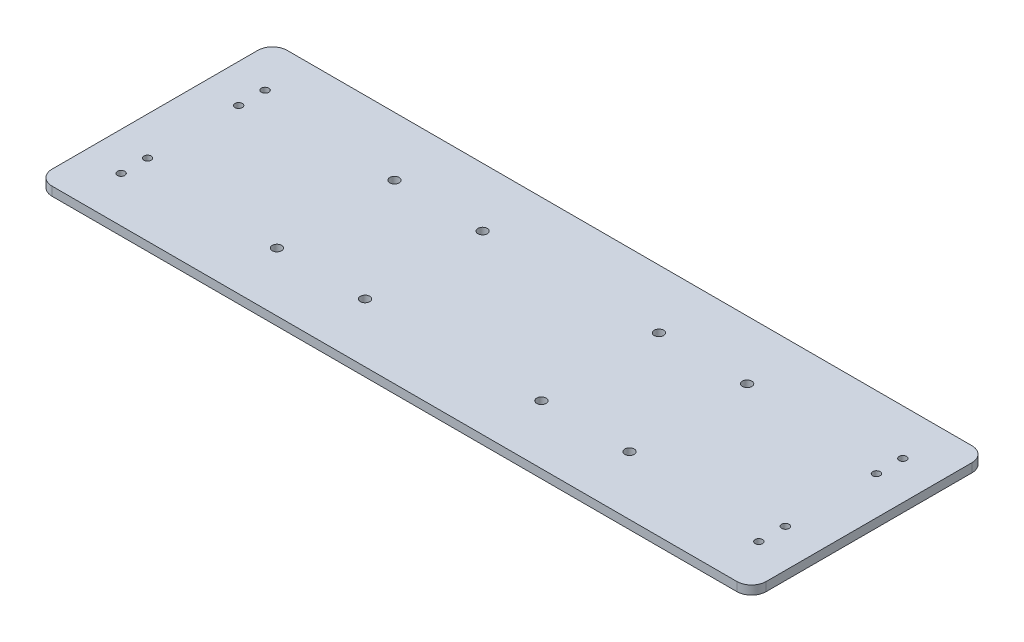
ISO-10303-21;
HEADER;
FILE_DESCRIPTION(('STEP AP214'),'2;1');
FILE_NAME('part.step','',(''),(''),'','','');
FILE_SCHEMA(('AUTOMOTIVE_DESIGN { 1 0 10303 214 1 1 1 1 }'));
ENDSEC;
DATA;
#1=APPLICATION_CONTEXT('core data for automotive mechanical design processes');
#2=APPLICATION_PROTOCOL_DEFINITION('international standard','automotive_design',2000,#1);
#3=PRODUCT_CONTEXT('',#1,'mechanical');
#4=PRODUCT('Part','Part','',(#3));
#5=PRODUCT_RELATED_PRODUCT_CATEGORY('part','',(#4));
#6=PRODUCT_DEFINITION_FORMATION('','',#4);
#7=PRODUCT_DEFINITION_CONTEXT('part definition',#1,'design');
#8=PRODUCT_DEFINITION('design','',#6,#7);
#9=PRODUCT_DEFINITION_SHAPE('','',#8);
#10=(LENGTH_UNIT() NAMED_UNIT(*) SI_UNIT(.MILLI.,.METRE.));
#11=(NAMED_UNIT(*) PLANE_ANGLE_UNIT() SI_UNIT($,.RADIAN.));
#12=(NAMED_UNIT(*) SI_UNIT($,.STERADIAN.) SOLID_ANGLE_UNIT());
#13=UNCERTAINTY_MEASURE_WITH_UNIT(LENGTH_MEASURE(1.E-05),#10,'distance_accuracy_value','');
#14=(GEOMETRIC_REPRESENTATION_CONTEXT(3) GLOBAL_UNCERTAINTY_ASSIGNED_CONTEXT((#13)) GLOBAL_UNIT_ASSIGNED_CONTEXT((#10,
#11,#12)) REPRESENTATION_CONTEXT('',''));
#15=CARTESIAN_POINT('',(0.,0.,0.));
#16=DIRECTION('',(0.,0.,1.));
#17=DIRECTION('',(1.,0.,0.));
#18=AXIS2_PLACEMENT_3D('',#15,#16,#17);
#19=CARTESIAN_POINT('',(0.,3.,0.));
#20=DIRECTION('',(1.,0.,0.));
#21=DIRECTION('',(0.,0.,-1.));
#22=AXIS2_PLACEMENT_3D('',#19,#20,#21);
#23=PLANE('',#22);
#24=DIRECTION('',(0.,0.,1.));
#25=VECTOR('',#24,1.);
#26=CARTESIAN_POINT('',(0.,0.,0.));
#27=LINE('',#26,#25);
#28=CARTESIAN_POINT('',(0.,0.,-75.));
#29=VERTEX_POINT('',#28);
#30=CARTESIAN_POINT('',(0.,0.,-5.));
#31=VERTEX_POINT('',#30);
#32=EDGE_CURVE('E140',#29,#31,#27,.T.);
#33=ORIENTED_EDGE('',*,*,#32,.T.);
#34=DIRECTION('',(0.,-1.,0.));
#35=VECTOR('',#34,1.);
#36=CARTESIAN_POINT('',(0.,3.,-5.));
#37=LINE('',#36,#35);
#38=CARTESIAN_POINT('',(0.,3.,-5.));
#39=VERTEX_POINT('',#38);
#40=EDGE_CURVE('E11',#31,#39,#37,.F.);
#41=ORIENTED_EDGE('',*,*,#40,.T.);
#42=DIRECTION('',(0.,0.,1.));
#43=VECTOR('',#42,1.);
#44=CARTESIAN_POINT('',(0.,3.,0.));
#45=LINE('',#44,#43);
#46=CARTESIAN_POINT('',(0.,3.,-75.));
#47=VERTEX_POINT('',#46);
#48=EDGE_CURVE('E138',#47,#39,#45,.T.);
#49=ORIENTED_EDGE('',*,*,#48,.F.);
#50=DIRECTION('',(0.,-1.,0.));
#51=VECTOR('',#50,1.);
#52=CARTESIAN_POINT('',(0.,3.,-75.));
#53=LINE('',#52,#51);
#54=EDGE_CURVE('E47',#47,#29,#53,.T.);
#55=ORIENTED_EDGE('',*,*,#54,.T.);
#56=EDGE_LOOP('',(#33,#41,#49,#55));
#57=FACE_BOUND('',#56,.T.);
#58=ADVANCED_FACE('F38',(#57),#23,.F.);
#59=CARTESIAN_POINT('',(0.,3.,0.));
#60=DIRECTION('',(0.,0.,-1.));
#61=DIRECTION('',(-1.,0.,0.));
#62=AXIS2_PLACEMENT_3D('',#59,#60,#61);
#63=PLANE('',#62);
#64=DIRECTION('',(1.,0.,0.));
#65=VECTOR('',#64,1.);
#66=CARTESIAN_POINT('',(0.,0.,0.));
#67=LINE('',#66,#65);
#68=CARTESIAN_POINT('',(5.,0.,0.));
#69=VERTEX_POINT('',#68);
#70=CARTESIAN_POINT('',(238.,0.,0.));
#71=VERTEX_POINT('',#70);
#72=EDGE_CURVE('E134',#69,#71,#67,.T.);
#73=ORIENTED_EDGE('',*,*,#72,.T.);
#74=DIRECTION('',(0.,-1.,0.));
#75=VECTOR('',#74,1.);
#76=CARTESIAN_POINT('',(238.,3.,0.));
#77=LINE('',#76,#75);
#78=CARTESIAN_POINT('',(238.,3.,0.));
#79=VERTEX_POINT('',#78);
#80=EDGE_CURVE('E110',#71,#79,#77,.F.);
#81=ORIENTED_EDGE('',*,*,#80,.T.);
#82=DIRECTION('',(1.,0.,0.));
#83=VECTOR('',#82,1.);
#84=CARTESIAN_POINT('',(0.,3.,0.));
#85=LINE('',#84,#83);
#86=CARTESIAN_POINT('',(5.,3.,0.));
#87=VERTEX_POINT('',#86);
#88=EDGE_CURVE('E197',#87,#79,#85,.T.);
#89=ORIENTED_EDGE('',*,*,#88,.F.);
#90=DIRECTION('',(0.,-1.,0.));
#91=VECTOR('',#90,1.);
#92=CARTESIAN_POINT('',(5.,3.,0.));
#93=LINE('',#92,#91);
#94=EDGE_CURVE('E116',#87,#69,#93,.T.);
#95=ORIENTED_EDGE('',*,*,#94,.T.);
#96=EDGE_LOOP('',(#73,#81,#89,#95));
#97=FACE_BOUND('',#96,.T.);
#98=ADVANCED_FACE('F372',(#97),#63,.F.);
#99=CARTESIAN_POINT('',(243.,3.,0.));
#100=DIRECTION('',(-1.,0.,0.));
#101=DIRECTION('',(0.,0.,1.));
#102=AXIS2_PLACEMENT_3D('',#99,#100,#101);
#103=PLANE('',#102);
#104=DIRECTION('',(0.,0.,-1.));
#105=VECTOR('',#104,1.);
#106=CARTESIAN_POINT('',(243.,3.,0.));
#107=LINE('',#106,#105);
#108=CARTESIAN_POINT('',(243.,3.,-5.));
#109=VERTEX_POINT('',#108);
#110=CARTESIAN_POINT('',(243.,3.,-75.));
#111=VERTEX_POINT('',#110);
#112=EDGE_CURVE('E125',#109,#111,#107,.T.);
#113=ORIENTED_EDGE('',*,*,#112,.F.);
#114=DIRECTION('',(0.,-1.,0.));
#115=VECTOR('',#114,1.);
#116=CARTESIAN_POINT('',(243.,3.,-5.));
#117=LINE('',#116,#115);
#118=CARTESIAN_POINT('',(243.,0.,-5.));
#119=VERTEX_POINT('',#118);
#120=EDGE_CURVE('E109',#109,#119,#117,.T.);
#121=ORIENTED_EDGE('',*,*,#120,.T.);
#122=DIRECTION('',(0.,0.,-1.));
#123=VECTOR('',#122,1.);
#124=CARTESIAN_POINT('',(243.,0.,0.));
#125=LINE('',#124,#123);
#126=CARTESIAN_POINT('',(243.,0.,-75.));
#127=VERTEX_POINT('',#126);
#128=EDGE_CURVE('E123',#119,#127,#125,.T.);
#129=ORIENTED_EDGE('',*,*,#128,.T.);
#130=DIRECTION('',(0.,-1.,0.));
#131=VECTOR('',#130,1.);
#132=CARTESIAN_POINT('',(243.,3.,-75.));
#133=LINE('',#132,#131);
#134=EDGE_CURVE('E128',#127,#111,#133,.F.);
#135=ORIENTED_EDGE('',*,*,#134,.T.);
#136=EDGE_LOOP('',(#113,#121,#129,#135));
#137=FACE_BOUND('',#136,.T.);
#138=ADVANCED_FACE('F122',(#137),#103,.F.);
#139=CARTESIAN_POINT('',(0.,3.,-80.));
#140=DIRECTION('',(0.,0.,1.));
#141=DIRECTION('',(1.,0.,0.));
#142=AXIS2_PLACEMENT_3D('',#139,#140,#141);
#143=PLANE('',#142);
#144=DIRECTION('',(-1.,0.,0.));
#145=VECTOR('',#144,1.);
#146=CARTESIAN_POINT('',(0.,3.,-80.));
#147=LINE('',#146,#145);
#148=CARTESIAN_POINT('',(238.,3.,-80.));
#149=VERTEX_POINT('',#148);
#150=CARTESIAN_POINT('',(5.,3.,-80.));
#151=VERTEX_POINT('',#150);
#152=EDGE_CURVE('E145',#149,#151,#147,.T.);
#153=ORIENTED_EDGE('',*,*,#152,.F.);
#154=DIRECTION('',(0.,-1.,0.));
#155=VECTOR('',#154,1.);
#156=CARTESIAN_POINT('',(238.,3.,-80.));
#157=LINE('',#156,#155);
#158=CARTESIAN_POINT('',(238.,0.,-80.));
#159=VERTEX_POINT('',#158);
#160=EDGE_CURVE('E172',#149,#159,#157,.T.);
#161=ORIENTED_EDGE('',*,*,#160,.T.);
#162=DIRECTION('',(-1.,0.,0.));
#163=VECTOR('',#162,1.);
#164=CARTESIAN_POINT('',(0.,0.,-80.));
#165=LINE('',#164,#163);
#166=CARTESIAN_POINT('',(5.,0.,-80.));
#167=VERTEX_POINT('',#166);
#168=EDGE_CURVE('E133',#159,#167,#165,.T.);
#169=ORIENTED_EDGE('',*,*,#168,.T.);
#170=DIRECTION('',(0.,-1.,0.));
#171=VECTOR('',#170,1.);
#172=CARTESIAN_POINT('',(5.,3.,-80.));
#173=LINE('',#172,#171);
#174=EDGE_CURVE('E54',#167,#151,#173,.F.);
#175=ORIENTED_EDGE('',*,*,#174,.T.);
#176=EDGE_LOOP('',(#153,#161,#169,#175));
#177=FACE_BOUND('',#176,.T.);
#178=ADVANCED_FACE('F365',(#177),#143,.F.);
#179=CARTESIAN_POINT('',(0.,3.,0.));
#180=DIRECTION('',(0.,-1.,0.));
#181=DIRECTION('',(0.,0.,-1.));
#182=AXIS2_PLACEMENT_3D('',#179,#180,#181);
#183=PLANE('',#182);
#184=CARTESIAN_POINT('',(91.5,3.,-20.));
#185=DIRECTION('',(0.,-1.,0.));
#186=DIRECTION('',(0.,0.,-1.));
#187=AXIS2_PLACEMENT_3D('',#184,#185,#186);
#188=CIRCLE('',#187,1.6);
#189=CARTESIAN_POINT('',(91.5,3.,-21.6));
#190=VERTEX_POINT('',#189);
#191=EDGE_CURVE('E256',#190,#190,#188,.T.);
#192=ORIENTED_EDGE('',*,*,#191,.T.);
#193=EDGE_LOOP('',(#192));
#194=FACE_BOUND('',#193,.T.);
#195=CARTESIAN_POINT('',(151.5,3.,-20.));
#196=DIRECTION('',(0.,-1.,0.));
#197=DIRECTION('',(0.,0.,-1.));
#198=AXIS2_PLACEMENT_3D('',#195,#196,#197);
#199=CIRCLE('',#198,1.60000000000002);
#200=CARTESIAN_POINT('',(151.5,3.,-21.6));
#201=VERTEX_POINT('',#200);
#202=EDGE_CURVE('E266',#201,#201,#199,.T.);
#203=ORIENTED_EDGE('',*,*,#202,.T.);
#204=EDGE_LOOP('',(#203));
#205=FACE_BOUND('',#204,.T.);
#206=CARTESIAN_POINT('',(181.5,3.,-20.));
#207=DIRECTION('',(0.,-1.,0.));
#208=DIRECTION('',(0.,0.,-1.));
#209=AXIS2_PLACEMENT_3D('',#206,#207,#208);
#210=CIRCLE('',#209,1.59999999999999);
#211=CARTESIAN_POINT('',(181.5,3.,-21.6));
#212=VERTEX_POINT('',#211);
#213=EDGE_CURVE('E270',#212,#212,#210,.T.);
#214=ORIENTED_EDGE('',*,*,#213,.T.);
#215=EDGE_LOOP('',(#214));
#216=FACE_BOUND('',#215,.T.);
#217=CARTESIAN_POINT('',(181.5,3.,-60.));
#218=DIRECTION('',(0.,-1.,0.));
#219=DIRECTION('',(0.,0.,-1.));
#220=AXIS2_PLACEMENT_3D('',#217,#218,#219);
#221=CIRCLE('',#220,1.59999999999999);
#222=CARTESIAN_POINT('',(181.5,3.,-61.6));
#223=VERTEX_POINT('',#222);
#224=EDGE_CURVE('E274',#223,#223,#221,.T.);
#225=ORIENTED_EDGE('',*,*,#224,.T.);
#226=EDGE_LOOP('',(#225));
#227=FACE_BOUND('',#226,.T.);
#228=CARTESIAN_POINT('',(151.5,3.,-60.));
#229=DIRECTION('',(0.,-1.,0.));
#230=DIRECTION('',(0.,0.,-1.));
#231=AXIS2_PLACEMENT_3D('',#228,#229,#230);
#232=CIRCLE('',#231,1.60000000000002);
#233=CARTESIAN_POINT('',(151.5,3.,-61.6));
#234=VERTEX_POINT('',#233);
#235=EDGE_CURVE('E278',#234,#234,#232,.T.);
#236=ORIENTED_EDGE('',*,*,#235,.T.);
#237=EDGE_LOOP('',(#236));
#238=FACE_BOUND('',#237,.T.);
#239=CARTESIAN_POINT('',(91.5,3.,-60.));
#240=DIRECTION('',(0.,-1.,0.));
#241=DIRECTION('',(0.,0.,-1.));
#242=AXIS2_PLACEMENT_3D('',#239,#240,#241);
#243=CIRCLE('',#242,1.6);
#244=CARTESIAN_POINT('',(91.5,3.,-61.6));
#245=VERTEX_POINT('',#244);
#246=EDGE_CURVE('E282',#245,#245,#243,.T.);
#247=ORIENTED_EDGE('',*,*,#246,.T.);
#248=EDGE_LOOP('',(#247));
#249=FACE_BOUND('',#248,.T.);
#250=CARTESIAN_POINT('',(61.5,3.,-60.));
#251=DIRECTION('',(0.,-1.,0.));
#252=DIRECTION('',(0.,0.,-1.));
#253=AXIS2_PLACEMENT_3D('',#250,#251,#252);
#254=CIRCLE('',#253,1.6);
#255=CARTESIAN_POINT('',(61.5,3.,-61.6));
#256=VERTEX_POINT('',#255);
#257=EDGE_CURVE('E286',#256,#256,#254,.T.);
#258=ORIENTED_EDGE('',*,*,#257,.T.);
#259=EDGE_LOOP('',(#258));
#260=FACE_BOUND('',#259,.T.);
#261=CARTESIAN_POINT('',(61.5,3.,-20.));
#262=DIRECTION('',(0.,-1.,0.));
#263=DIRECTION('',(0.,0.,-1.));
#264=AXIS2_PLACEMENT_3D('',#261,#262,#263);
#265=CIRCLE('',#264,1.6);
#266=CARTESIAN_POINT('',(61.5,3.,-21.6));
#267=VERTEX_POINT('',#266);
#268=EDGE_CURVE('E290',#267,#267,#265,.T.);
#269=ORIENTED_EDGE('',*,*,#268,.T.);
#270=EDGE_LOOP('',(#269));
#271=FACE_BOUND('',#270,.T.);
#272=CARTESIAN_POINT('',(230.,3.,-55.4999999999999));
#273=DIRECTION('',(0.,-1.,0.));
#274=DIRECTION('',(0.,0.,-1.));
#275=AXIS2_PLACEMENT_3D('',#272,#273,#274);
#276=CIRCLE('',#275,1.24999999999998);
#277=CARTESIAN_POINT('',(230.,3.,-56.7499999999999));
#278=VERTEX_POINT('',#277);
#279=EDGE_CURVE('E187',#278,#278,#276,.T.);
#280=ORIENTED_EDGE('',*,*,#279,.T.);
#281=EDGE_LOOP('',(#280));
#282=FACE_BOUND('',#281,.T.);
#283=CARTESIAN_POINT('',(13.,3.,-15.5));
#284=DIRECTION('',(0.,-1.,0.));
#285=DIRECTION('',(0.,0.,-1.));
#286=AXIS2_PLACEMENT_3D('',#283,#284,#285);
#287=CIRCLE('',#286,1.25);
#288=CARTESIAN_POINT('',(13.,3.,-16.75));
#289=VERTEX_POINT('',#288);
#290=EDGE_CURVE('E190',#289,#289,#287,.T.);
#291=ORIENTED_EDGE('',*,*,#290,.T.);
#292=EDGE_LOOP('',(#291));
#293=FACE_BOUND('',#292,.T.);
#294=CARTESIAN_POINT('',(13.,3.,-24.5));
#295=DIRECTION('',(0.,-1.,0.));
#296=DIRECTION('',(0.,0.,-1.));
#297=AXIS2_PLACEMENT_3D('',#294,#295,#296);
#298=CIRCLE('',#297,1.25);
#299=CARTESIAN_POINT('',(13.,3.,-25.75));
#300=VERTEX_POINT('',#299);
#301=EDGE_CURVE('E206',#300,#300,#298,.T.);
#302=ORIENTED_EDGE('',*,*,#301,.T.);
#303=EDGE_LOOP('',(#302));
#304=FACE_BOUND('',#303,.T.);
#305=CARTESIAN_POINT('',(13.,3.,-55.5));
#306=DIRECTION('',(0.,-1.,0.));
#307=DIRECTION('',(0.,0.,-1.));
#308=AXIS2_PLACEMENT_3D('',#305,#306,#307);
#309=CIRCLE('',#308,1.25);
#310=CARTESIAN_POINT('',(13.,3.,-56.75));
#311=VERTEX_POINT('',#310);
#312=EDGE_CURVE('E210',#311,#311,#309,.T.);
#313=ORIENTED_EDGE('',*,*,#312,.T.);
#314=EDGE_LOOP('',(#313));
#315=FACE_BOUND('',#314,.T.);
#316=CARTESIAN_POINT('',(230.,3.,-64.4999999999999));
#317=DIRECTION('',(0.,-1.,0.));
#318=DIRECTION('',(0.,0.,-1.));
#319=AXIS2_PLACEMENT_3D('',#316,#317,#318);
#320=CIRCLE('',#319,1.24999999999998);
#321=CARTESIAN_POINT('',(230.,3.,-65.7499999999999));
#322=VERTEX_POINT('',#321);
#323=EDGE_CURVE('E214',#322,#322,#320,.T.);
#324=ORIENTED_EDGE('',*,*,#323,.T.);
#325=EDGE_LOOP('',(#324));
#326=FACE_BOUND('',#325,.T.);
#327=CARTESIAN_POINT('',(230.,3.,-24.4999999999999));
#328=DIRECTION('',(0.,-1.,0.));
#329=DIRECTION('',(0.,0.,-1.));
#330=AXIS2_PLACEMENT_3D('',#327,#328,#329);
#331=CIRCLE('',#330,1.25000000000001);
#332=CARTESIAN_POINT('',(230.,3.,-25.7499999999999));
#333=VERTEX_POINT('',#332);
#334=EDGE_CURVE('E218',#333,#333,#331,.T.);
#335=ORIENTED_EDGE('',*,*,#334,.T.);
#336=EDGE_LOOP('',(#335));
#337=FACE_BOUND('',#336,.T.);
#338=CARTESIAN_POINT('',(230.,3.,-15.4999999999999));
#339=DIRECTION('',(0.,-1.,0.));
#340=DIRECTION('',(0.,0.,-1.));
#341=AXIS2_PLACEMENT_3D('',#338,#339,#340);
#342=CIRCLE('',#341,1.25000000000001);
#343=CARTESIAN_POINT('',(230.,3.,-16.7499999999999));
#344=VERTEX_POINT('',#343);
#345=EDGE_CURVE('E222',#344,#344,#342,.T.);
#346=ORIENTED_EDGE('',*,*,#345,.T.);
#347=EDGE_LOOP('',(#346));
#348=FACE_BOUND('',#347,.T.);
#349=CARTESIAN_POINT('',(13.,3.,-64.5));
#350=DIRECTION('',(0.,-1.,0.));
#351=DIRECTION('',(0.,0.,-1.));
#352=AXIS2_PLACEMENT_3D('',#349,#350,#351);
#353=CIRCLE('',#352,1.25);
#354=CARTESIAN_POINT('',(13.,3.,-65.75));
#355=VERTEX_POINT('',#354);
#356=EDGE_CURVE('E226',#355,#355,#353,.T.);
#357=ORIENTED_EDGE('',*,*,#356,.T.);
#358=EDGE_LOOP('',(#357));
#359=FACE_BOUND('',#358,.T.);
#360=ORIENTED_EDGE('',*,*,#88,.T.);
#361=CARTESIAN_POINT('',(238.,3.,-5.));
#362=DIRECTION('',(0.,-1.,0.));
#363=DIRECTION('',(0.,0.,-1.));
#364=AXIS2_PLACEMENT_3D('',#361,#362,#363);
#365=CIRCLE('',#364,5.);
#366=EDGE_CURVE('E167',#79,#109,#365,.F.);
#367=ORIENTED_EDGE('',*,*,#366,.T.);
#368=ORIENTED_EDGE('',*,*,#112,.T.);
#369=CARTESIAN_POINT('',(238.,3.,-75.));
#370=DIRECTION('',(0.,-1.,0.));
#371=DIRECTION('',(0.,0.,-1.));
#372=AXIS2_PLACEMENT_3D('',#369,#370,#371);
#373=CIRCLE('',#372,5.);
#374=EDGE_CURVE('E61',#111,#149,#373,.F.);
#375=ORIENTED_EDGE('',*,*,#374,.T.);
#376=ORIENTED_EDGE('',*,*,#152,.T.);
#377=CARTESIAN_POINT('',(5.,3.,-75.));
#378=DIRECTION('',(0.,-1.,0.));
#379=DIRECTION('',(0.,0.,-1.));
#380=AXIS2_PLACEMENT_3D('',#377,#378,#379);
#381=CIRCLE('',#380,5.);
#382=EDGE_CURVE('E159',#151,#47,#381,.F.);
#383=ORIENTED_EDGE('',*,*,#382,.T.);
#384=ORIENTED_EDGE('',*,*,#48,.T.);
#385=CARTESIAN_POINT('',(5.,3.,-5.));
#386=DIRECTION('',(0.,-1.,0.));
#387=DIRECTION('',(0.,0.,-1.));
#388=AXIS2_PLACEMENT_3D('',#385,#386,#387);
#389=CIRCLE('',#388,5.);
#390=EDGE_CURVE('E162',#39,#87,#389,.F.);
#391=ORIENTED_EDGE('',*,*,#390,.T.);
#392=EDGE_LOOP('',(#360,#367,#368,#375,#376,#383,#384,#391));
#393=FACE_BOUND('',#392,.T.);
#394=ADVANCED_FACE('F333',(#194,#205,#216,#227,#238,#249,#260,#271,#282,#293,#304,#315,#326,
#337,#348,#359,#393),#183,.F.);
#395=CARTESIAN_POINT('',(0.,0.,0.));
#396=DIRECTION('',(0.,-1.,0.));
#397=DIRECTION('',(0.,0.,-1.));
#398=AXIS2_PLACEMENT_3D('',#395,#396,#397);
#399=PLANE('',#398);
#400=CARTESIAN_POINT('',(91.5,0.,-20.));
#401=DIRECTION('',(0.,-1.,0.));
#402=DIRECTION('',(0.,0.,-1.));
#403=AXIS2_PLACEMENT_3D('',#400,#401,#402);
#404=CIRCLE('',#403,1.6);
#405=CARTESIAN_POINT('',(91.5,0.,-21.6));
#406=VERTEX_POINT('',#405);
#407=EDGE_CURVE('E298',#406,#406,#404,.T.);
#408=ORIENTED_EDGE('',*,*,#407,.F.);
#409=EDGE_LOOP('',(#408));
#410=FACE_BOUND('',#409,.T.);
#411=CARTESIAN_POINT('',(151.5,0.,-20.));
#412=DIRECTION('',(0.,-1.,0.));
#413=DIRECTION('',(0.,0.,1.));
#414=AXIS2_PLACEMENT_3D('',#411,#412,#413);
#415=CIRCLE('',#414,1.60000000000002);
#416=CARTESIAN_POINT('',(151.5,0.,-18.4));
#417=VERTEX_POINT('',#416);
#418=EDGE_CURVE('E308',#417,#417,#415,.T.);
#419=ORIENTED_EDGE('',*,*,#418,.F.);
#420=EDGE_LOOP('',(#419));
#421=FACE_BOUND('',#420,.T.);
#422=CARTESIAN_POINT('',(181.5,0.,-20.));
#423=DIRECTION('',(0.,-1.,0.));
#424=DIRECTION('',(0.,0.,1.));
#425=AXIS2_PLACEMENT_3D('',#422,#423,#424);
#426=CIRCLE('',#425,1.59999999999999);
#427=CARTESIAN_POINT('',(181.5,0.,-18.4));
#428=VERTEX_POINT('',#427);
#429=EDGE_CURVE('E303',#428,#428,#426,.T.);
#430=ORIENTED_EDGE('',*,*,#429,.F.);
#431=EDGE_LOOP('',(#430));
#432=FACE_BOUND('',#431,.T.);
#433=CARTESIAN_POINT('',(181.5,0.,-60.));
#434=DIRECTION('',(0.,-1.,0.));
#435=DIRECTION('',(0.,0.,-1.));
#436=AXIS2_PLACEMENT_3D('',#433,#434,#435);
#437=CIRCLE('',#436,1.59999999999999);
#438=CARTESIAN_POINT('',(181.5,0.,-61.6));
#439=VERTEX_POINT('',#438);
#440=EDGE_CURVE('E299',#439,#439,#437,.T.);
#441=ORIENTED_EDGE('',*,*,#440,.F.);
#442=EDGE_LOOP('',(#441));
#443=FACE_BOUND('',#442,.T.);
#444=CARTESIAN_POINT('',(151.5,0.,-60.));
#445=DIRECTION('',(0.,-1.,0.));
#446=DIRECTION('',(0.,0.,-1.));
#447=AXIS2_PLACEMENT_3D('',#444,#445,#446);
#448=CIRCLE('',#447,1.60000000000002);
#449=CARTESIAN_POINT('',(151.5,0.,-61.6));
#450=VERTEX_POINT('',#449);
#451=EDGE_CURVE('E304',#450,#450,#448,.T.);
#452=ORIENTED_EDGE('',*,*,#451,.F.);
#453=EDGE_LOOP('',(#452));
#454=FACE_BOUND('',#453,.T.);
#455=CARTESIAN_POINT('',(91.5,0.,-60.));
#456=DIRECTION('',(0.,-1.,0.));
#457=DIRECTION('',(0.,0.,1.));
#458=AXIS2_PLACEMENT_3D('',#455,#456,#457);
#459=CIRCLE('',#458,1.6);
#460=CARTESIAN_POINT('',(91.5,0.,-58.4));
#461=VERTEX_POINT('',#460);
#462=EDGE_CURVE('E319',#461,#461,#459,.T.);
#463=ORIENTED_EDGE('',*,*,#462,.F.);
#464=EDGE_LOOP('',(#463));
#465=FACE_BOUND('',#464,.T.);
#466=CARTESIAN_POINT('',(61.5,0.,-60.));
#467=DIRECTION('',(0.,-1.,0.));
#468=DIRECTION('',(0.,0.,1.));
#469=AXIS2_PLACEMENT_3D('',#466,#467,#468);
#470=CIRCLE('',#469,1.6);
#471=CARTESIAN_POINT('',(61.5,0.,-58.4));
#472=VERTEX_POINT('',#471);
#473=EDGE_CURVE('E315',#472,#472,#470,.T.);
#474=ORIENTED_EDGE('',*,*,#473,.F.);
#475=EDGE_LOOP('',(#474));
#476=FACE_BOUND('',#475,.T.);
#477=CARTESIAN_POINT('',(61.5,0.,-20.));
#478=DIRECTION('',(0.,-1.,0.));
#479=DIRECTION('',(0.,0.,-1.));
#480=AXIS2_PLACEMENT_3D('',#477,#478,#479);
#481=CIRCLE('',#480,1.6);
#482=CARTESIAN_POINT('',(61.5,0.,-21.6));
#483=VERTEX_POINT('',#482);
#484=EDGE_CURVE('E294',#483,#483,#481,.T.);
#485=ORIENTED_EDGE('',*,*,#484,.F.);
#486=EDGE_LOOP('',(#485));
#487=FACE_BOUND('',#486,.T.);
#488=CARTESIAN_POINT('',(230.,0.,-55.4999999999999));
#489=DIRECTION('',(0.,-1.,0.));
#490=DIRECTION('',(0.,0.,-1.));
#491=AXIS2_PLACEMENT_3D('',#488,#489,#490);
#492=CIRCLE('',#491,1.24999999999998);
#493=CARTESIAN_POINT('',(230.,0.,-56.7499999999999));
#494=VERTEX_POINT('',#493);
#495=EDGE_CURVE('E243',#494,#494,#492,.T.);
#496=ORIENTED_EDGE('',*,*,#495,.F.);
#497=EDGE_LOOP('',(#496));
#498=FACE_BOUND('',#497,.T.);
#499=CARTESIAN_POINT('',(13.,0.,-15.5));
#500=DIRECTION('',(0.,-1.,0.));
#501=DIRECTION('',(0.,0.,-1.));
#502=AXIS2_PLACEMENT_3D('',#499,#500,#501);
#503=CIRCLE('',#502,1.25);
#504=CARTESIAN_POINT('',(13.,0.,-16.75));
#505=VERTEX_POINT('',#504);
#506=EDGE_CURVE('E239',#505,#505,#503,.T.);
#507=ORIENTED_EDGE('',*,*,#506,.F.);
#508=EDGE_LOOP('',(#507));
#509=FACE_BOUND('',#508,.T.);
#510=CARTESIAN_POINT('',(13.,0.,-24.5));
#511=DIRECTION('',(0.,-1.,0.));
#512=DIRECTION('',(0.,0.,-1.));
#513=AXIS2_PLACEMENT_3D('',#510,#511,#512);
#514=CIRCLE('',#513,1.25);
#515=CARTESIAN_POINT('',(13.,0.,-25.75));
#516=VERTEX_POINT('',#515);
#517=EDGE_CURVE('E235',#516,#516,#514,.T.);
#518=ORIENTED_EDGE('',*,*,#517,.F.);
#519=EDGE_LOOP('',(#518));
#520=FACE_BOUND('',#519,.T.);
#521=CARTESIAN_POINT('',(13.,0.,-55.5));
#522=DIRECTION('',(0.,-1.,0.));
#523=DIRECTION('',(0.,0.,-1.));
#524=AXIS2_PLACEMENT_3D('',#521,#522,#523);
#525=CIRCLE('',#524,1.25);
#526=CARTESIAN_POINT('',(13.,0.,-56.75));
#527=VERTEX_POINT('',#526);
#528=EDGE_CURVE('E234',#527,#527,#525,.T.);
#529=ORIENTED_EDGE('',*,*,#528,.F.);
#530=EDGE_LOOP('',(#529));
#531=FACE_BOUND('',#530,.T.);
#532=CARTESIAN_POINT('',(230.,0.,-64.4999999999999));
#533=DIRECTION('',(0.,-1.,0.));
#534=DIRECTION('',(0.,0.,-1.));
#535=AXIS2_PLACEMENT_3D('',#532,#533,#534);
#536=CIRCLE('',#535,1.24999999999998);
#537=CARTESIAN_POINT('',(230.,0.,-65.7499999999999));
#538=VERTEX_POINT('',#537);
#539=EDGE_CURVE('E247',#538,#538,#536,.T.);
#540=ORIENTED_EDGE('',*,*,#539,.F.);
#541=EDGE_LOOP('',(#540));
#542=FACE_BOUND('',#541,.T.);
#543=CARTESIAN_POINT('',(230.,0.,-24.4999999999999));
#544=DIRECTION('',(0.,-1.,0.));
#545=DIRECTION('',(0.,0.,-1.));
#546=AXIS2_PLACEMENT_3D('',#543,#544,#545);
#547=CIRCLE('',#546,1.25000000000001);
#548=CARTESIAN_POINT('',(230.,0.,-25.7499999999999));
#549=VERTEX_POINT('',#548);
#550=EDGE_CURVE('E255',#549,#549,#547,.T.);
#551=ORIENTED_EDGE('',*,*,#550,.F.);
#552=EDGE_LOOP('',(#551));
#553=FACE_BOUND('',#552,.T.);
#554=CARTESIAN_POINT('',(230.,0.,-15.4999999999999));
#555=DIRECTION('',(0.,-1.,0.));
#556=DIRECTION('',(0.,0.,-1.));
#557=AXIS2_PLACEMENT_3D('',#554,#555,#556);
#558=CIRCLE('',#557,1.25000000000001);
#559=CARTESIAN_POINT('',(230.,0.,-16.7499999999999));
#560=VERTEX_POINT('',#559);
#561=EDGE_CURVE('E251',#560,#560,#558,.T.);
#562=ORIENTED_EDGE('',*,*,#561,.F.);
#563=EDGE_LOOP('',(#562));
#564=FACE_BOUND('',#563,.T.);
#565=CARTESIAN_POINT('',(13.,0.,-64.5));
#566=DIRECTION('',(0.,-1.,0.));
#567=DIRECTION('',(0.,0.,-1.));
#568=AXIS2_PLACEMENT_3D('',#565,#566,#567);
#569=CIRCLE('',#568,1.25);
#570=CARTESIAN_POINT('',(13.,0.,-65.75));
#571=VERTEX_POINT('',#570);
#572=EDGE_CURVE('E230',#571,#571,#569,.T.);
#573=ORIENTED_EDGE('',*,*,#572,.F.);
#574=EDGE_LOOP('',(#573));
#575=FACE_BOUND('',#574,.T.);
#576=ORIENTED_EDGE('',*,*,#128,.F.);
#577=CARTESIAN_POINT('',(238.,0.,-5.));
#578=DIRECTION('',(0.,-1.,0.));
#579=DIRECTION('',(0.,0.,-1.));
#580=AXIS2_PLACEMENT_3D('',#577,#578,#579);
#581=CIRCLE('',#580,5.);
#582=EDGE_CURVE('E105',#119,#71,#581,.T.);
#583=ORIENTED_EDGE('',*,*,#582,.T.);
#584=ORIENTED_EDGE('',*,*,#72,.F.);
#585=CARTESIAN_POINT('',(5.,0.,-5.));
#586=DIRECTION('',(0.,-1.,0.));
#587=DIRECTION('',(0.,0.,-1.));
#588=AXIS2_PLACEMENT_3D('',#585,#586,#587);
#589=CIRCLE('',#588,5.);
#590=EDGE_CURVE('E149',#69,#31,#589,.T.);
#591=ORIENTED_EDGE('',*,*,#590,.T.);
#592=ORIENTED_EDGE('',*,*,#32,.F.);
#593=CARTESIAN_POINT('',(5.,0.,-75.));
#594=DIRECTION('',(0.,-1.,0.));
#595=DIRECTION('',(0.,0.,-1.));
#596=AXIS2_PLACEMENT_3D('',#593,#594,#595);
#597=CIRCLE('',#596,5.);
#598=EDGE_CURVE('E127',#29,#167,#597,.T.);
#599=ORIENTED_EDGE('',*,*,#598,.T.);
#600=ORIENTED_EDGE('',*,*,#168,.F.);
#601=CARTESIAN_POINT('',(238.,0.,-75.));
#602=DIRECTION('',(0.,-1.,0.));
#603=DIRECTION('',(0.,0.,-1.));
#604=AXIS2_PLACEMENT_3D('',#601,#602,#603);
#605=CIRCLE('',#604,5.);
#606=EDGE_CURVE('E117',#159,#127,#605,.T.);
#607=ORIENTED_EDGE('',*,*,#606,.T.);
#608=EDGE_LOOP('',(#576,#583,#584,#591,#592,#599,#600,#607));
#609=FACE_BOUND('',#608,.T.);
#610=ADVANCED_FACE('F130',(#410,#421,#432,#443,#454,#465,#476,#487,#498,#509,#520,#531,#542,
#553,#564,#575,#609),#399,.T.);
#611=CARTESIAN_POINT('',(13.,10.,-64.5));
#612=DIRECTION('',(0.,-1.,0.));
#613=DIRECTION('',(0.,0.,-1.));
#614=AXIS2_PLACEMENT_3D('',#611,#612,#613);
#615=CYLINDRICAL_SURFACE('',#614,1.25);
#616=ORIENTED_EDGE('',*,*,#572,.T.);
#617=EDGE_LOOP('',(#616));
#618=FACE_BOUND('',#617,.T.);
#619=ORIENTED_EDGE('',*,*,#356,.F.);
#620=EDGE_LOOP('',(#619));
#621=FACE_BOUND('',#620,.T.);
#622=ADVANCED_FACE('F332',(#618,#621),#615,.F.);
#623=CARTESIAN_POINT('',(230.,10.,-15.4999999999999));
#624=DIRECTION('',(0.,-1.,0.));
#625=DIRECTION('',(0.,0.,-1.));
#626=AXIS2_PLACEMENT_3D('',#623,#624,#625);
#627=CYLINDRICAL_SURFACE('',#626,1.25000000000001);
#628=ORIENTED_EDGE('',*,*,#561,.T.);
#629=EDGE_LOOP('',(#628));
#630=FACE_BOUND('',#629,.T.);
#631=ORIENTED_EDGE('',*,*,#345,.F.);
#632=EDGE_LOOP('',(#631));
#633=FACE_BOUND('',#632,.T.);
#634=ADVANCED_FACE('F360',(#630,#633),#627,.F.);
#635=CARTESIAN_POINT('',(230.,10.,-24.4999999999999));
#636=DIRECTION('',(0.,-1.,0.));
#637=DIRECTION('',(0.,0.,-1.));
#638=AXIS2_PLACEMENT_3D('',#635,#636,#637);
#639=CYLINDRICAL_SURFACE('',#638,1.25000000000001);
#640=ORIENTED_EDGE('',*,*,#550,.T.);
#641=EDGE_LOOP('',(#640));
#642=FACE_BOUND('',#641,.T.);
#643=ORIENTED_EDGE('',*,*,#334,.F.);
#644=EDGE_LOOP('',(#643));
#645=FACE_BOUND('',#644,.T.);
#646=ADVANCED_FACE('F426',(#642,#645),#639,.F.);
#647=CARTESIAN_POINT('',(230.,10.,-64.4999999999999));
#648=DIRECTION('',(0.,-1.,0.));
#649=DIRECTION('',(0.,0.,-1.));
#650=AXIS2_PLACEMENT_3D('',#647,#648,#649);
#651=CYLINDRICAL_SURFACE('',#650,1.24999999999998);
#652=ORIENTED_EDGE('',*,*,#539,.T.);
#653=EDGE_LOOP('',(#652));
#654=FACE_BOUND('',#653,.T.);
#655=ORIENTED_EDGE('',*,*,#323,.F.);
#656=EDGE_LOOP('',(#655));
#657=FACE_BOUND('',#656,.T.);
#658=ADVANCED_FACE('F416',(#654,#657),#651,.F.);
#659=CARTESIAN_POINT('',(13.,10.,-55.5));
#660=DIRECTION('',(0.,-1.,0.));
#661=DIRECTION('',(0.,0.,-1.));
#662=AXIS2_PLACEMENT_3D('',#659,#660,#661);
#663=CYLINDRICAL_SURFACE('',#662,1.25);
#664=ORIENTED_EDGE('',*,*,#528,.T.);
#665=EDGE_LOOP('',(#664));
#666=FACE_BOUND('',#665,.T.);
#667=ORIENTED_EDGE('',*,*,#312,.F.);
#668=EDGE_LOOP('',(#667));
#669=FACE_BOUND('',#668,.T.);
#670=ADVANCED_FACE('F412',(#666,#669),#663,.F.);
#671=CARTESIAN_POINT('',(13.,10.,-24.5));
#672=DIRECTION('',(0.,-1.,0.));
#673=DIRECTION('',(0.,0.,-1.));
#674=AXIS2_PLACEMENT_3D('',#671,#672,#673);
#675=CYLINDRICAL_SURFACE('',#674,1.25);
#676=ORIENTED_EDGE('',*,*,#517,.T.);
#677=EDGE_LOOP('',(#676));
#678=FACE_BOUND('',#677,.T.);
#679=ORIENTED_EDGE('',*,*,#301,.F.);
#680=EDGE_LOOP('',(#679));
#681=FACE_BOUND('',#680,.T.);
#682=ADVANCED_FACE('F408',(#678,#681),#675,.F.);
#683=CARTESIAN_POINT('',(13.,10.,-15.5));
#684=DIRECTION('',(0.,-1.,0.));
#685=DIRECTION('',(0.,0.,-1.));
#686=AXIS2_PLACEMENT_3D('',#683,#684,#685);
#687=CYLINDRICAL_SURFACE('',#686,1.25);
#688=ORIENTED_EDGE('',*,*,#506,.T.);
#689=EDGE_LOOP('',(#688));
#690=FACE_BOUND('',#689,.T.);
#691=ORIENTED_EDGE('',*,*,#290,.F.);
#692=EDGE_LOOP('',(#691));
#693=FACE_BOUND('',#692,.T.);
#694=ADVANCED_FACE('F411',(#690,#693),#687,.F.);
#695=CARTESIAN_POINT('',(230.,10.,-55.4999999999999));
#696=DIRECTION('',(0.,-1.,0.));
#697=DIRECTION('',(0.,0.,-1.));
#698=AXIS2_PLACEMENT_3D('',#695,#696,#697);
#699=CYLINDRICAL_SURFACE('',#698,1.24999999999998);
#700=ORIENTED_EDGE('',*,*,#495,.T.);
#701=EDGE_LOOP('',(#700));
#702=FACE_BOUND('',#701,.T.);
#703=ORIENTED_EDGE('',*,*,#279,.F.);
#704=EDGE_LOOP('',(#703));
#705=FACE_BOUND('',#704,.T.);
#706=ADVANCED_FACE('F395',(#702,#705),#699,.F.);
#707=CARTESIAN_POINT('',(238.,3.,-5.));
#708=DIRECTION('',(0.,-1.,0.));
#709=DIRECTION('',(0.,0.,-1.));
#710=AXIS2_PLACEMENT_3D('',#707,#708,#709);
#711=CYLINDRICAL_SURFACE('',#710,5.);
#712=ORIENTED_EDGE('',*,*,#366,.F.);
#713=ORIENTED_EDGE('',*,*,#80,.F.);
#714=ORIENTED_EDGE('',*,*,#582,.F.);
#715=ORIENTED_EDGE('',*,*,#120,.F.);
#716=EDGE_LOOP('',(#712,#713,#714,#715));
#717=FACE_BOUND('',#716,.T.);
#718=ADVANCED_FACE('F108',(#717),#711,.T.);
#719=CARTESIAN_POINT('',(238.,3.,-75.));
#720=DIRECTION('',(0.,-1.,0.));
#721=DIRECTION('',(0.,0.,-1.));
#722=AXIS2_PLACEMENT_3D('',#719,#720,#721);
#723=CYLINDRICAL_SURFACE('',#722,5.);
#724=ORIENTED_EDGE('',*,*,#374,.F.);
#725=ORIENTED_EDGE('',*,*,#134,.F.);
#726=ORIENTED_EDGE('',*,*,#606,.F.);
#727=ORIENTED_EDGE('',*,*,#160,.F.);
#728=EDGE_LOOP('',(#724,#725,#726,#727));
#729=FACE_BOUND('',#728,.T.);
#730=ADVANCED_FACE('F384',(#729),#723,.T.);
#731=CARTESIAN_POINT('',(5.,3.,-5.));
#732=DIRECTION('',(0.,-1.,0.));
#733=DIRECTION('',(0.,0.,-1.));
#734=AXIS2_PLACEMENT_3D('',#731,#732,#733);
#735=CYLINDRICAL_SURFACE('',#734,5.);
#736=ORIENTED_EDGE('',*,*,#390,.F.);
#737=ORIENTED_EDGE('',*,*,#40,.F.);
#738=ORIENTED_EDGE('',*,*,#590,.F.);
#739=ORIENTED_EDGE('',*,*,#94,.F.);
#740=EDGE_LOOP('',(#736,#737,#738,#739));
#741=FACE_BOUND('',#740,.T.);
#742=ADVANCED_FACE('F374',(#741),#735,.T.);
#743=CARTESIAN_POINT('',(5.,3.,-75.));
#744=DIRECTION('',(0.,-1.,0.));
#745=DIRECTION('',(0.,0.,-1.));
#746=AXIS2_PLACEMENT_3D('',#743,#744,#745);
#747=CYLINDRICAL_SURFACE('',#746,5.);
#748=ORIENTED_EDGE('',*,*,#382,.F.);
#749=ORIENTED_EDGE('',*,*,#174,.F.);
#750=ORIENTED_EDGE('',*,*,#598,.F.);
#751=ORIENTED_EDGE('',*,*,#54,.F.);
#752=EDGE_LOOP('',(#748,#749,#750,#751));
#753=FACE_BOUND('',#752,.T.);
#754=ADVANCED_FACE('F40',(#753),#747,.T.);
#755=CARTESIAN_POINT('',(61.5,10.,-20.));
#756=DIRECTION('',(0.,-1.,0.));
#757=DIRECTION('',(0.,0.,-1.));
#758=AXIS2_PLACEMENT_3D('',#755,#756,#757);
#759=CYLINDRICAL_SURFACE('',#758,1.6);
#760=ORIENTED_EDGE('',*,*,#484,.T.);
#761=EDGE_LOOP('',(#760));
#762=FACE_BOUND('',#761,.T.);
#763=ORIENTED_EDGE('',*,*,#268,.F.);
#764=EDGE_LOOP('',(#763));
#765=FACE_BOUND('',#764,.T.);
#766=ADVANCED_FACE('F376',(#762,#765),#759,.F.);
#767=CARTESIAN_POINT('',(61.5,10.,-60.));
#768=DIRECTION('',(0.,-1.,0.));
#769=DIRECTION('',(0.,0.,-1.));
#770=AXIS2_PLACEMENT_3D('',#767,#768,#769);
#771=CYLINDRICAL_SURFACE('',#770,1.6);
#772=ORIENTED_EDGE('',*,*,#473,.T.);
#773=EDGE_LOOP('',(#772));
#774=FACE_BOUND('',#773,.T.);
#775=ORIENTED_EDGE('',*,*,#257,.F.);
#776=EDGE_LOOP('',(#775));
#777=FACE_BOUND('',#776,.T.);
#778=ADVANCED_FACE('F381',(#774,#777),#771,.F.);
#779=CARTESIAN_POINT('',(91.5,10.,-60.));
#780=DIRECTION('',(0.,-1.,0.));
#781=DIRECTION('',(0.,0.,-1.));
#782=AXIS2_PLACEMENT_3D('',#779,#780,#781);
#783=CYLINDRICAL_SURFACE('',#782,1.6);
#784=ORIENTED_EDGE('',*,*,#462,.T.);
#785=EDGE_LOOP('',(#784));
#786=FACE_BOUND('',#785,.T.);
#787=ORIENTED_EDGE('',*,*,#246,.F.);
#788=EDGE_LOOP('',(#787));
#789=FACE_BOUND('',#788,.T.);
#790=ADVANCED_FACE('F452',(#786,#789),#783,.F.);
#791=CARTESIAN_POINT('',(151.5,10.,-60.));
#792=DIRECTION('',(0.,-1.,0.));
#793=DIRECTION('',(0.,0.,-1.));
#794=AXIS2_PLACEMENT_3D('',#791,#792,#793);
#795=CYLINDRICAL_SURFACE('',#794,1.60000000000002);
#796=ORIENTED_EDGE('',*,*,#451,.T.);
#797=EDGE_LOOP('',(#796));
#798=FACE_BOUND('',#797,.T.);
#799=ORIENTED_EDGE('',*,*,#235,.F.);
#800=EDGE_LOOP('',(#799));
#801=FACE_BOUND('',#800,.T.);
#802=ADVANCED_FACE('F327',(#798,#801),#795,.F.);
#803=CARTESIAN_POINT('',(181.5,10.,-60.));
#804=DIRECTION('',(0.,-1.,0.));
#805=DIRECTION('',(0.,0.,-1.));
#806=AXIS2_PLACEMENT_3D('',#803,#804,#805);
#807=CYLINDRICAL_SURFACE('',#806,1.59999999999999);
#808=ORIENTED_EDGE('',*,*,#440,.T.);
#809=EDGE_LOOP('',(#808));
#810=FACE_BOUND('',#809,.T.);
#811=ORIENTED_EDGE('',*,*,#224,.F.);
#812=EDGE_LOOP('',(#811));
#813=FACE_BOUND('',#812,.T.);
#814=ADVANCED_FACE('F434',(#810,#813),#807,.F.);
#815=CARTESIAN_POINT('',(181.5,10.,-20.));
#816=DIRECTION('',(0.,-1.,0.));
#817=DIRECTION('',(0.,0.,-1.));
#818=AXIS2_PLACEMENT_3D('',#815,#816,#817);
#819=CYLINDRICAL_SURFACE('',#818,1.59999999999999);
#820=ORIENTED_EDGE('',*,*,#429,.T.);
#821=EDGE_LOOP('',(#820));
#822=FACE_BOUND('',#821,.T.);
#823=ORIENTED_EDGE('',*,*,#213,.F.);
#824=EDGE_LOOP('',(#823));
#825=FACE_BOUND('',#824,.T.);
#826=ADVANCED_FACE('F437',(#822,#825),#819,.F.);
#827=CARTESIAN_POINT('',(151.5,10.,-20.));
#828=DIRECTION('',(0.,-1.,0.));
#829=DIRECTION('',(0.,0.,-1.));
#830=AXIS2_PLACEMENT_3D('',#827,#828,#829);
#831=CYLINDRICAL_SURFACE('',#830,1.60000000000002);
#832=ORIENTED_EDGE('',*,*,#418,.T.);
#833=EDGE_LOOP('',(#832));
#834=FACE_BOUND('',#833,.T.);
#835=ORIENTED_EDGE('',*,*,#202,.F.);
#836=EDGE_LOOP('',(#835));
#837=FACE_BOUND('',#836,.T.);
#838=ADVANCED_FACE('F441',(#834,#837),#831,.F.);
#839=CARTESIAN_POINT('',(91.5,10.,-20.));
#840=DIRECTION('',(0.,-1.,0.));
#841=DIRECTION('',(0.,0.,-1.));
#842=AXIS2_PLACEMENT_3D('',#839,#840,#841);
#843=CYLINDRICAL_SURFACE('',#842,1.6);
#844=ORIENTED_EDGE('',*,*,#407,.T.);
#845=EDGE_LOOP('',(#844));
#846=FACE_BOUND('',#845,.T.);
#847=ORIENTED_EDGE('',*,*,#191,.F.);
#848=EDGE_LOOP('',(#847));
#849=FACE_BOUND('',#848,.T.);
#850=ADVANCED_FACE('F445',(#846,#849),#843,.F.);
#851=CLOSED_SHELL('',(#58,#98,#138,#178,#394,#610,#622,#634,#646,#658,#670,#682,#694,#706,#718,
#730,#742,#754,#766,#778,#790,#802,#814,#826,#838,#850));
#852=MANIFOLD_SOLID_BREP('B2',#851);
#853=ADVANCED_BREP_SHAPE_REPRESENTATION('',(#18,#852),#14);
#854=SHAPE_DEFINITION_REPRESENTATION(#9,#853);
ENDSEC;
END-ISO-10303-21;
